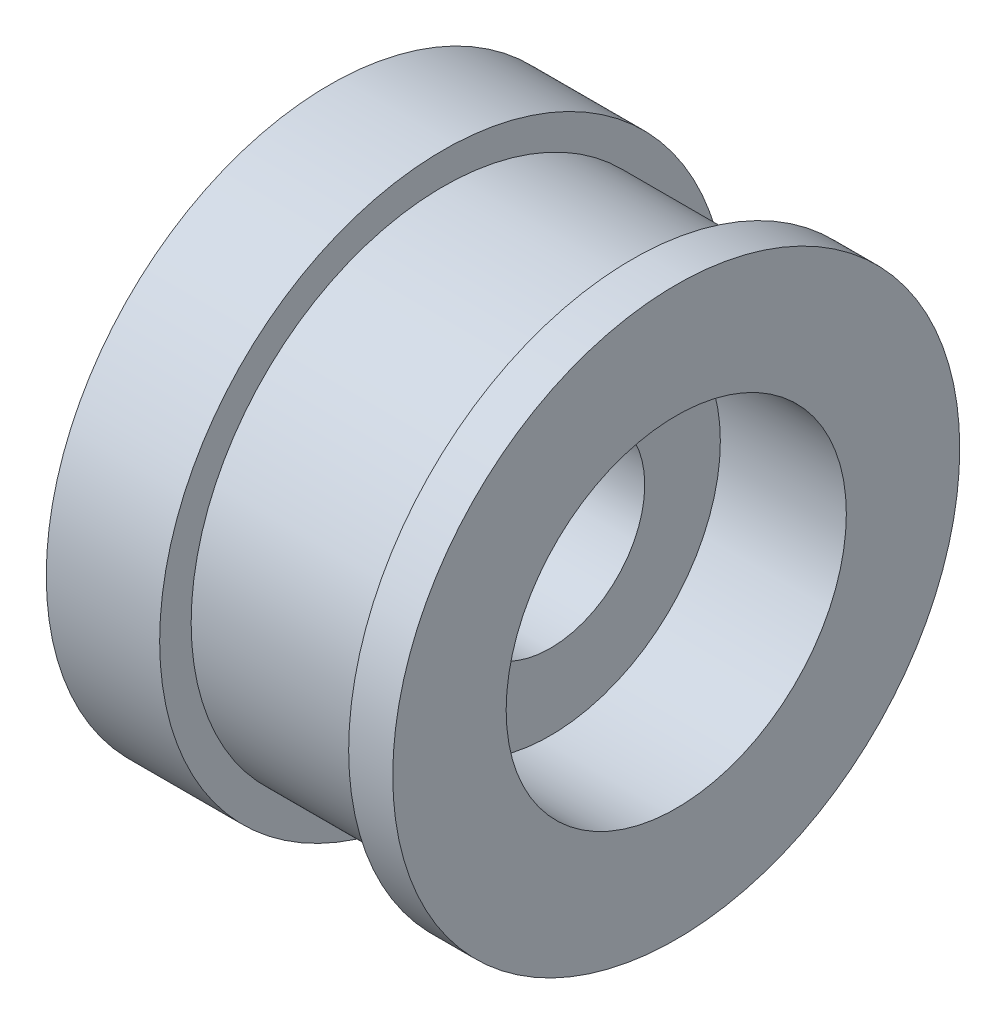
ISO-10303-21;
HEADER;
FILE_DESCRIPTION(('STEP AP214'),'2;1');
FILE_NAME('part.step','',(''),(''),'','','');
FILE_SCHEMA(('AUTOMOTIVE_DESIGN { 1 0 10303 214 1 1 1 1 }'));
ENDSEC;
DATA;
#1=APPLICATION_CONTEXT('core data for automotive mechanical design processes');
#2=APPLICATION_PROTOCOL_DEFINITION('international standard','automotive_design',2000,#1);
#3=PRODUCT_CONTEXT('',#1,'mechanical');
#4=PRODUCT('Part','Part','',(#3));
#5=PRODUCT_RELATED_PRODUCT_CATEGORY('part','',(#4));
#6=PRODUCT_DEFINITION_FORMATION('','',#4);
#7=PRODUCT_DEFINITION_CONTEXT('part definition',#1,'design');
#8=PRODUCT_DEFINITION('design','',#6,#7);
#9=PRODUCT_DEFINITION_SHAPE('','',#8);
#10=(LENGTH_UNIT() NAMED_UNIT(*) SI_UNIT(.MILLI.,.METRE.));
#11=(NAMED_UNIT(*) PLANE_ANGLE_UNIT() SI_UNIT($,.RADIAN.));
#12=(NAMED_UNIT(*) SI_UNIT($,.STERADIAN.) SOLID_ANGLE_UNIT());
#13=UNCERTAINTY_MEASURE_WITH_UNIT(LENGTH_MEASURE(1.E-05),#10,'distance_accuracy_value','');
#14=(GEOMETRIC_REPRESENTATION_CONTEXT(3) GLOBAL_UNCERTAINTY_ASSIGNED_CONTEXT((#13)) GLOBAL_UNIT_ASSIGNED_CONTEXT((#10,
#11,#12)) REPRESENTATION_CONTEXT('',''));
#15=CARTESIAN_POINT('',(0.,0.,0.));
#16=DIRECTION('',(0.,0.,1.));
#17=DIRECTION('',(1.,0.,0.));
#18=AXIS2_PLACEMENT_3D('',#15,#16,#17);
#19=CARTESIAN_POINT('',(10.,0.,0.));
#20=DIRECTION('',(-1.,0.,0.));
#21=DIRECTION('',(0.,0.,1.));
#22=AXIS2_PLACEMENT_3D('',#19,#20,#21);
#23=CYLINDRICAL_SURFACE('',#22,1.5);
#24=CARTESIAN_POINT('',(0.,0.,0.));
#25=DIRECTION('',(-1.,0.,0.));
#26=DIRECTION('',(0.,0.,1.));
#27=AXIS2_PLACEMENT_3D('',#24,#25,#26);
#28=CIRCLE('',#27,1.5);
#29=CARTESIAN_POINT('',(0.,0.,1.5));
#30=VERTEX_POINT('',#29);
#31=EDGE_CURVE('E60',#30,#30,#28,.T.);
#32=ORIENTED_EDGE('',*,*,#31,.T.);
#33=EDGE_LOOP('',(#32));
#34=FACE_BOUND('',#33,.T.);
#35=CARTESIAN_POINT('',(3.5,0.,0.));
#36=DIRECTION('',(1.,0.,0.));
#37=DIRECTION('',(0.,0.,-1.));
#38=AXIS2_PLACEMENT_3D('',#35,#36,#37);
#39=CIRCLE('',#38,1.5);
#40=CARTESIAN_POINT('',(3.5,0.,-1.5));
#41=VERTEX_POINT('',#40);
#42=EDGE_CURVE('E38',#41,#41,#39,.F.);
#43=ORIENTED_EDGE('',*,*,#42,.F.);
#44=EDGE_LOOP('',(#43));
#45=FACE_BOUND('',#44,.T.);
#46=ADVANCED_FACE('F34',(#34,#45),#23,.F.);
#47=CARTESIAN_POINT('',(5.5,0.,0.));
#48=DIRECTION('',(-1.,0.,0.));
#49=DIRECTION('',(0.,0.,1.));
#50=AXIS2_PLACEMENT_3D('',#47,#48,#49);
#51=PLANE('',#50);
#52=CARTESIAN_POINT('',(5.5,0.,0.));
#53=DIRECTION('',(1.,0.,0.));
#54=DIRECTION('',(0.,0.,-1.));
#55=AXIS2_PLACEMENT_3D('',#52,#53,#54);
#56=CIRCLE('',#55,2.7);
#57=CARTESIAN_POINT('',(5.5,0.,-2.7));
#58=VERTEX_POINT('',#57);
#59=EDGE_CURVE('E63',#58,#58,#56,.T.);
#60=ORIENTED_EDGE('',*,*,#59,.F.);
#61=EDGE_LOOP('',(#60));
#62=FACE_BOUND('',#61,.T.);
#63=CARTESIAN_POINT('',(5.50000000000001,0.,0.));
#64=DIRECTION('',(-1.,0.,0.));
#65=DIRECTION('',(0.,0.,1.));
#66=AXIS2_PLACEMENT_3D('',#63,#64,#65);
#67=CIRCLE('',#66,4.5);
#68=CARTESIAN_POINT('',(5.50000000000001,0.,4.5));
#69=VERTEX_POINT('',#68);
#70=EDGE_CURVE('E10',#69,#69,#67,.T.);
#71=ORIENTED_EDGE('',*,*,#70,.F.);
#72=EDGE_LOOP('',(#71));
#73=FACE_BOUND('',#72,.T.);
#74=ADVANCED_FACE('F36',(#62,#73),#51,.F.);
#75=CARTESIAN_POINT('',(-92.3357649099317,0.,0.));
#76=DIRECTION('',(-1.,0.,0.));
#77=DIRECTION('',(0.,0.,1.));
#78=AXIS2_PLACEMENT_3D('',#75,#76,#77);
#79=CYLINDRICAL_SURFACE('',#78,4.5);
#80=CARTESIAN_POINT('',(4.8,0.,0.));
#81=DIRECTION('',(-1.,0.,0.));
#82=DIRECTION('',(0.,0.,1.));
#83=AXIS2_PLACEMENT_3D('',#80,#81,#82);
#84=CIRCLE('',#83,4.5);
#85=CARTESIAN_POINT('',(4.8,0.,4.5));
#86=VERTEX_POINT('',#85);
#87=EDGE_CURVE('E42',#86,#86,#84,.T.);
#88=ORIENTED_EDGE('',*,*,#87,.F.);
#89=EDGE_LOOP('',(#88));
#90=FACE_BOUND('',#89,.T.);
#91=ORIENTED_EDGE('',*,*,#70,.T.);
#92=EDGE_LOOP('',(#91));
#93=FACE_BOUND('',#92,.T.);
#94=ADVANCED_FACE('F81',(#90,#93),#79,.T.);
#95=CARTESIAN_POINT('',(4.8,0.,-4.5));
#96=DIRECTION('',(1.,0.,0.));
#97=DIRECTION('',(0.,0.,-1.));
#98=AXIS2_PLACEMENT_3D('',#95,#96,#97);
#99=PLANE('',#98);
#100=CARTESIAN_POINT('',(4.8,0.,0.));
#101=DIRECTION('',(-1.,0.,0.));
#102=DIRECTION('',(0.,0.,1.));
#103=AXIS2_PLACEMENT_3D('',#100,#101,#102);
#104=CIRCLE('',#103,4.);
#105=CARTESIAN_POINT('',(4.8,0.,4.));
#106=VERTEX_POINT('',#105);
#107=EDGE_CURVE('E46',#106,#106,#104,.T.);
#108=ORIENTED_EDGE('',*,*,#107,.F.);
#109=EDGE_LOOP('',(#108));
#110=FACE_BOUND('',#109,.T.);
#111=ORIENTED_EDGE('',*,*,#87,.T.);
#112=EDGE_LOOP('',(#111));
#113=FACE_BOUND('',#112,.T.);
#114=ADVANCED_FACE('F102',(#110,#113),#99,.F.);
#115=CARTESIAN_POINT('',(-92.3357649099317,0.,0.));
#116=DIRECTION('',(-1.,0.,0.));
#117=DIRECTION('',(0.,0.,1.));
#118=AXIS2_PLACEMENT_3D('',#115,#116,#117);
#119=CYLINDRICAL_SURFACE('',#118,4.);
#120=CARTESIAN_POINT('',(1.8,0.,0.));
#121=DIRECTION('',(-1.,0.,0.));
#122=DIRECTION('',(0.,0.,1.));
#123=AXIS2_PLACEMENT_3D('',#120,#121,#122);
#124=CIRCLE('',#123,4.);
#125=CARTESIAN_POINT('',(1.8,0.,4.));
#126=VERTEX_POINT('',#125);
#127=EDGE_CURVE('E51',#126,#126,#124,.T.);
#128=ORIENTED_EDGE('',*,*,#127,.F.);
#129=EDGE_LOOP('',(#128));
#130=FACE_BOUND('',#129,.T.);
#131=ORIENTED_EDGE('',*,*,#107,.T.);
#132=EDGE_LOOP('',(#131));
#133=FACE_BOUND('',#132,.T.);
#134=ADVANCED_FACE('F98',(#130,#133),#119,.T.);
#135=CARTESIAN_POINT('',(1.8,0.,-4.));
#136=DIRECTION('',(-1.,0.,0.));
#137=DIRECTION('',(0.,0.,1.));
#138=AXIS2_PLACEMENT_3D('',#135,#136,#137);
#139=PLANE('',#138);
#140=CARTESIAN_POINT('',(1.8,0.,0.));
#141=DIRECTION('',(-1.,0.,0.));
#142=DIRECTION('',(0.,0.,1.));
#143=AXIS2_PLACEMENT_3D('',#140,#141,#142);
#144=CIRCLE('',#143,4.5);
#145=CARTESIAN_POINT('',(1.8,0.,4.5));
#146=VERTEX_POINT('',#145);
#147=EDGE_CURVE('E54',#146,#146,#144,.T.);
#148=ORIENTED_EDGE('',*,*,#147,.F.);
#149=EDGE_LOOP('',(#148));
#150=FACE_BOUND('',#149,.T.);
#151=ORIENTED_EDGE('',*,*,#127,.T.);
#152=EDGE_LOOP('',(#151));
#153=FACE_BOUND('',#152,.T.);
#154=ADVANCED_FACE('F94',(#150,#153),#139,.F.);
#155=CARTESIAN_POINT('',(-92.3357649099317,0.,0.));
#156=DIRECTION('',(-1.,0.,0.));
#157=DIRECTION('',(0.,0.,1.));
#158=AXIS2_PLACEMENT_3D('',#155,#156,#157);
#159=CYLINDRICAL_SURFACE('',#158,4.5);
#160=CARTESIAN_POINT('',(0.,0.,0.));
#161=DIRECTION('',(-1.,0.,0.));
#162=DIRECTION('',(0.,0.,1.));
#163=AXIS2_PLACEMENT_3D('',#160,#161,#162);
#164=CIRCLE('',#163,4.5);
#165=CARTESIAN_POINT('',(0.,0.,4.5));
#166=VERTEX_POINT('',#165);
#167=EDGE_CURVE('E57',#166,#166,#164,.T.);
#168=ORIENTED_EDGE('',*,*,#167,.F.);
#169=EDGE_LOOP('',(#168));
#170=FACE_BOUND('',#169,.T.);
#171=ORIENTED_EDGE('',*,*,#147,.T.);
#172=EDGE_LOOP('',(#171));
#173=FACE_BOUND('',#172,.T.);
#174=ADVANCED_FACE('F90',(#170,#173),#159,.T.);
#175=CARTESIAN_POINT('',(0.,0.,0.));
#176=DIRECTION('',(1.,0.,0.));
#177=DIRECTION('',(0.,0.,-1.));
#178=AXIS2_PLACEMENT_3D('',#175,#176,#177);
#179=PLANE('',#178);
#180=ORIENTED_EDGE('',*,*,#31,.F.);
#181=EDGE_LOOP('',(#180));
#182=FACE_BOUND('',#181,.T.);
#183=ORIENTED_EDGE('',*,*,#167,.T.);
#184=EDGE_LOOP('',(#183));
#185=FACE_BOUND('',#184,.T.);
#186=ADVANCED_FACE('F87',(#182,#185),#179,.F.);
#187=CARTESIAN_POINT('',(3.5,0.,0.));
#188=DIRECTION('',(1.,0.,0.));
#189=DIRECTION('',(0.,0.,-1.));
#190=AXIS2_PLACEMENT_3D('',#187,#188,#189);
#191=PLANE('',#190);
#192=CARTESIAN_POINT('',(3.5,0.,0.));
#193=DIRECTION('',(1.,0.,0.));
#194=DIRECTION('',(0.,0.,-1.));
#195=AXIS2_PLACEMENT_3D('',#192,#193,#194);
#196=CIRCLE('',#195,2.7);
#197=CARTESIAN_POINT('',(3.5,0.,-2.7));
#198=VERTEX_POINT('',#197);
#199=EDGE_CURVE('E66',#198,#198,#196,.T.);
#200=ORIENTED_EDGE('',*,*,#199,.T.);
#201=EDGE_LOOP('',(#200));
#202=FACE_BOUND('',#201,.T.);
#203=ORIENTED_EDGE('',*,*,#42,.T.);
#204=EDGE_LOOP('',(#203));
#205=FACE_BOUND('',#204,.T.);
#206=ADVANCED_FACE('F73',(#202,#205),#191,.T.);
#207=CARTESIAN_POINT('',(3.5,0.,0.));
#208=DIRECTION('',(1.,0.,0.));
#209=DIRECTION('',(0.,0.,-1.));
#210=AXIS2_PLACEMENT_3D('',#207,#208,#209);
#211=CYLINDRICAL_SURFACE('',#210,2.7);
#212=ORIENTED_EDGE('',*,*,#199,.F.);
#213=EDGE_LOOP('',(#212));
#214=FACE_BOUND('',#213,.T.);
#215=ORIENTED_EDGE('',*,*,#59,.T.);
#216=EDGE_LOOP('',(#215));
#217=FACE_BOUND('',#216,.T.);
#218=ADVANCED_FACE('F85',(#214,#217),#211,.F.);
#219=CLOSED_SHELL('',(#46,#74,#94,#114,#134,#154,#174,#186,#206,#218));
#220=MANIFOLD_SOLID_BREP('B2',#219);
#221=ADVANCED_BREP_SHAPE_REPRESENTATION('',(#18,#220),#14);
#222=SHAPE_DEFINITION_REPRESENTATION(#9,#221);
ENDSEC;
END-ISO-10303-21;
